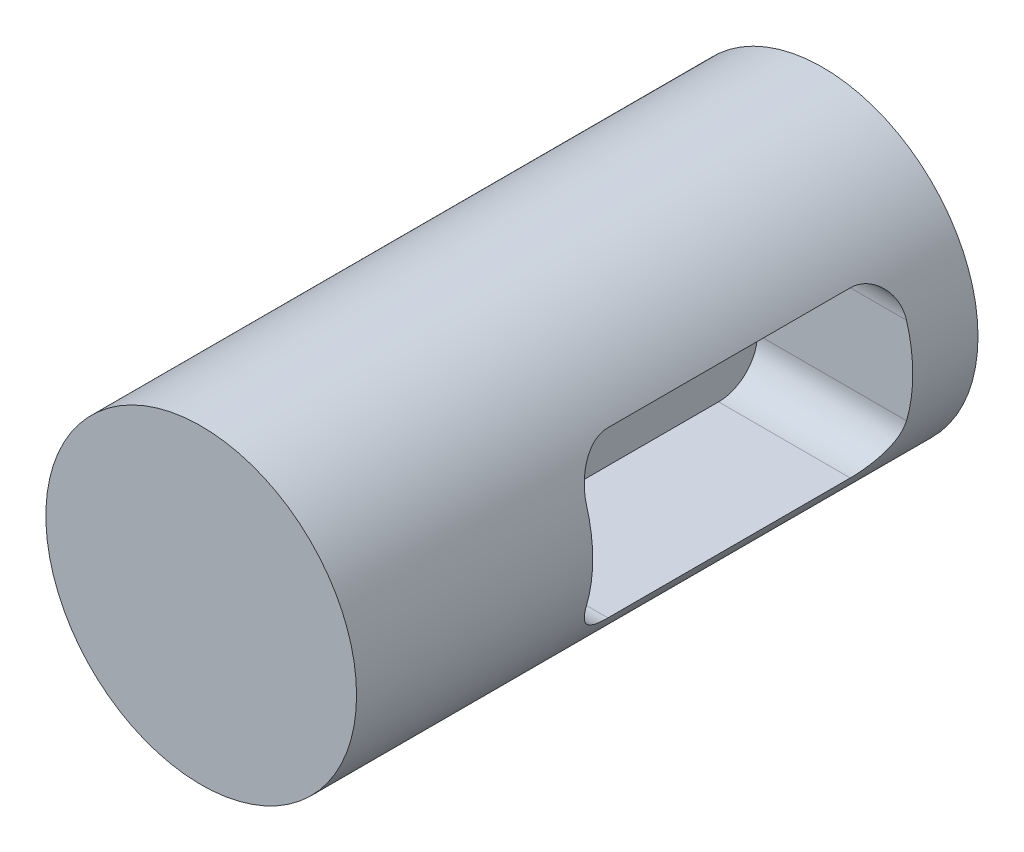
ISO-10303-21;
HEADER;
FILE_DESCRIPTION(('STEP AP214'),'2;1');
FILE_NAME('part.step','',(''),(''),'','','');
FILE_SCHEMA(('AUTOMOTIVE_DESIGN { 1 0 10303 214 1 1 1 1 }'));
ENDSEC;
DATA;
#1=APPLICATION_CONTEXT('core data for automotive mechanical design processes');
#2=APPLICATION_PROTOCOL_DEFINITION('international standard','automotive_design',2000,#1);
#3=PRODUCT_CONTEXT('',#1,'mechanical');
#4=PRODUCT('Part','Part','',(#3));
#5=PRODUCT_RELATED_PRODUCT_CATEGORY('part','',(#4));
#6=PRODUCT_DEFINITION_FORMATION('','',#4);
#7=PRODUCT_DEFINITION_CONTEXT('part definition',#1,'design');
#8=PRODUCT_DEFINITION('design','',#6,#7);
#9=PRODUCT_DEFINITION_SHAPE('','',#8);
#10=(LENGTH_UNIT() NAMED_UNIT(*) SI_UNIT(.MILLI.,.METRE.));
#11=(NAMED_UNIT(*) PLANE_ANGLE_UNIT() SI_UNIT($,.RADIAN.));
#12=(NAMED_UNIT(*) SI_UNIT($,.STERADIAN.) SOLID_ANGLE_UNIT());
#13=UNCERTAINTY_MEASURE_WITH_UNIT(LENGTH_MEASURE(1.E-05),#10,'distance_accuracy_value','');
#14=(GEOMETRIC_REPRESENTATION_CONTEXT(3) GLOBAL_UNCERTAINTY_ASSIGNED_CONTEXT((#13)) GLOBAL_UNIT_ASSIGNED_CONTEXT((#10,
#11,#12)) REPRESENTATION_CONTEXT('',''));
#15=CARTESIAN_POINT('',(0.,0.,0.));
#16=DIRECTION('',(0.,0.,1.));
#17=DIRECTION('',(1.,0.,0.));
#18=AXIS2_PLACEMENT_3D('',#15,#16,#17);
#19=CARTESIAN_POINT('',(0.,0.,25.4));
#20=DIRECTION('',(0.,0.,-1.));
#21=DIRECTION('',(-1.,0.,0.));
#22=AXIS2_PLACEMENT_3D('',#19,#20,#21);
#23=CYLINDRICAL_SURFACE('',#22,6.35);
#24=DIRECTION('',(0.,0.,-1.));
#25=VECTOR('',#24,1.);
#26=CARTESIAN_POINT('',(5.38478502356408,-3.3655,25.4));
#27=LINE('',#26,#25);
#28=CARTESIAN_POINT('',(5.38478502356408,-3.3655,4.25449999999999));
#29=VERTEX_POINT('',#28);
#30=CARTESIAN_POINT('',(5.38478502356408,-3.3655,14.1605));
#31=VERTEX_POINT('',#30);
#32=EDGE_CURVE('E108',#29,#31,#27,.F.);
#33=ORIENTED_EDGE('',*,*,#32,.T.);
#34=CARTESIAN_POINT('',(5.38478502356408,-3.3655,14.1605));
#35=CARTESIAN_POINT('',(5.38477998550626,-3.36550311420515,14.20101203173));
#36=CARTESIAN_POINT('',(5.38575522648882,-3.36394812123358,14.2415015406982));
#37=CARTESIAN_POINT('',(5.38961219981472,-3.35776719840829,14.3221329914184));
#38=CARTESIAN_POINT('',(5.39249292135221,-3.35314289673525,14.3622751060221));
#39=CARTESIAN_POINT('',(5.40386439535,-3.33481114785113,14.4812737444031));
#40=CARTESIAN_POINT('',(5.41508593867461,-3.31664348735243,14.5592361667822));
#41=CARTESIAN_POINT('',(5.44376315368653,-3.2693565459825,14.7103020550338));
#42=CARTESIAN_POINT('',(5.46120807948618,-3.24025613806757,14.7834136403405));
#43=CARTESIAN_POINT('',(5.50098527677485,-3.17225638135873,14.9235738198209));
#44=CARTESIAN_POINT('',(5.52332410052259,-3.13334388487345,14.9906141136424));
#45=CARTESIAN_POINT('',(5.57330813320664,-3.04361057836643,15.1223841627002));
#46=CARTESIAN_POINT('',(5.6012291879031,-2.99210448743698,15.186540543386));
#47=CARTESIAN_POINT('',(5.65943721389089,-2.88049223107019,15.3056353247192));
#48=CARTESIAN_POINT('',(5.68972532260729,-2.8203819194222,15.36056925335));
#49=CARTESIAN_POINT('',(5.75526538440766,-2.68436798987406,15.4670443206058));
#50=CARTESIAN_POINT('',(5.79064595234728,-2.60742699769628,15.5171871130744));
#51=CARTESIAN_POINT('',(5.86071404444277,-2.4458699687299,15.6035855213563));
#52=CARTESIAN_POINT('',(5.89540183705766,-2.36125697822874,15.6398466195068));
#53=CARTESIAN_POINT('',(5.95926042903676,-2.19473555526361,15.6945771171678));
#54=CARTESIAN_POINT('',(5.98863940672925,-2.11336753370209,15.7144363082967));
#55=CARTESIAN_POINT('',(6.0305998217557,-1.98904317353163,15.7344715475499));
#56=CARTESIAN_POINT('',(6.04424609886898,-1.94718606286673,15.7395245062857));
#57=CARTESIAN_POINT('',(6.07074320620199,-1.86293652596954,15.7462893444277));
#58=CARTESIAN_POINT('',(6.08359373197673,-1.82054390223364,15.7479999526446));
#59=CARTESIAN_POINT('',(6.096,-1.778,15.748));
#60=B_SPLINE_CURVE_WITH_KNOTS('',3,(#34,#35,#36,#37,#38,#39,#40,#41,#42,#43,#44,#45,#46,#47,#48,
#49,#50,#51,#52,#53,#54,#55,#56,#57,#58,#59),.UNSPECIFIED.,.F.,.F.,(4,2,2,2,2,2,2,2,2,2,2,2,4),
(0.,0.12145137546125,0.242838375870251,0.484034404424227,0.724815960746434,0.965921882473373,
1.22555440272633,1.48531245880474,1.77926163651441,2.07309460397963,2.33828411730118,
2.47110726953453,2.60398092829714),.UNSPECIFIED.);
#61=CARTESIAN_POINT('',(6.096,-1.778,15.748));
#62=VERTEX_POINT('',#61);
#63=EDGE_CURVE('E103',#31,#62,#60,.T.);
#64=ORIENTED_EDGE('',*,*,#63,.T.);
#65=CARTESIAN_POINT('',(0.,0.,15.748));
#66=DIRECTION('',(0.,0.,1.));
#67=DIRECTION('',(1.,0.,0.));
#68=AXIS2_PLACEMENT_3D('',#65,#66,#67);
#69=CIRCLE('',#68,6.35);
#70=CARTESIAN_POINT('',(6.096,1.778,15.748));
#71=VERTEX_POINT('',#70);
#72=EDGE_CURVE('E106',#62,#71,#69,.T.);
#73=ORIENTED_EDGE('',*,*,#72,.T.);
#74=CARTESIAN_POINT('',(6.096,1.778,15.748));
#75=CARTESIAN_POINT('',(6.08220857294816,1.82529666651743,15.747999560892));
#76=CARTESIAN_POINT('',(6.06786833797167,1.87240148720645,15.7458856209723));
#77=CARTESIAN_POINT('',(6.03821801684065,1.96591496350725,15.7375378834173));
#78=CARTESIAN_POINT('',(6.02290834754174,2.01232390786945,15.7313058458274));
#79=CARTESIAN_POINT('',(5.97580369970062,2.14979133030365,15.7066456078919));
#80=CARTESIAN_POINT('',(5.94273903782364,2.23941115383783,15.6822517666915));
#81=CARTESIAN_POINT('',(5.87470910290941,2.41224654937741,15.6187078254658));
#82=CARTESIAN_POINT('',(5.83974629858731,2.49547011524194,15.5795765172478));
#83=CARTESIAN_POINT('',(5.76945694208624,2.65393762954683,15.487634831525));
#84=CARTESIAN_POINT('',(5.73413008161663,2.72917407830562,15.434811755195));
#85=CARTESIAN_POINT('',(5.66364835809544,2.87266996410929,15.3141834079219));
#86=CARTESIAN_POINT('',(5.62855684034355,2.94053019195874,15.2458635727381));
#87=CARTESIAN_POINT('',(5.56253667857178,3.06358721613167,15.0968550416709));
#88=CARTESIAN_POINT('',(5.53160775685789,3.1187848573715,15.0161671716494));
#89=CARTESIAN_POINT('',(5.47812403660483,3.21176102360573,14.8483833153988));
#90=CARTESIAN_POINT('',(5.45522565647593,3.25027746463575,14.7618155078795));
#91=CARTESIAN_POINT('',(5.42750166735631,3.29621601765496,14.6268078280298));
#92=CARTESIAN_POINT('',(5.41936778603499,3.30955077092803,14.5809811803964));
#93=CARTESIAN_POINT('',(5.40553829228129,3.33209122457196,14.4879750237745));
#94=CARTESIAN_POINT('',(5.39984099950403,3.34129977070942,14.4407964711357));
#95=CARTESIAN_POINT('',(5.39193125314568,3.35404588613129,14.3547772182831));
#96=CARTESIAN_POINT('',(5.38925803013075,3.35833562623373,14.3160878545575));
#97=CARTESIAN_POINT('',(5.38568196644751,3.36406484368941,14.2384352931643));
#98=CARTESIAN_POINT('',(5.38477834104934,3.36550558443707,14.1994722245678));
#99=CARTESIAN_POINT('',(5.38478502356408,3.3655,14.1605));
#100=B_SPLINE_CURVE_WITH_KNOTS('',3,(#74,#75,#76,#77,#78,#79,#80,#81,#82,#83,#84,#85,#86,#87,
#88,#89,#90,#91,#92,#93,#94,#95,#96,#97,#98,#99),.UNSPECIFIED.,.F.,.F.,(4,2,2,2,2,2,2,2,2,2,2,2,
4),(0.,0.147694205216291,0.295325327783691,0.58959809839714,0.883496904016399,1.17766927605321,
1.48360289266421,1.78951608978612,2.08000601234498,2.2250399138325,2.36997363365343,
2.48688841719431,2.6037513430056),.UNSPECIFIED.);
#101=CARTESIAN_POINT('',(5.38478502356408,3.3655,14.1605));
#102=VERTEX_POINT('',#101);
#103=EDGE_CURVE('E113',#71,#102,#100,.T.);
#104=ORIENTED_EDGE('',*,*,#103,.T.);
#105=DIRECTION('',(0.,0.,-1.));
#106=VECTOR('',#105,1.);
#107=CARTESIAN_POINT('',(5.38478502356408,3.3655,25.4));
#108=LINE('',#107,#106);
#109=CARTESIAN_POINT('',(5.38478502356408,3.3655,4.25449999999999));
#110=VERTEX_POINT('',#109);
#111=EDGE_CURVE('E128',#102,#110,#108,.T.);
#112=ORIENTED_EDGE('',*,*,#111,.T.);
#113=CARTESIAN_POINT('',(5.38478502356408,3.3655,4.2545));
#114=CARTESIAN_POINT('',(5.38477998550626,3.36550311420515,4.21398796827003));
#115=CARTESIAN_POINT('',(5.38575522648882,3.36394812123358,4.17349845930179));
#116=CARTESIAN_POINT('',(5.38961219981471,3.35776719840829,4.0928670085816));
#117=CARTESIAN_POINT('',(5.39249292135221,3.35314289673525,4.05272489397793));
#118=CARTESIAN_POINT('',(5.40386439535,3.33481114785113,3.93372625559689));
#119=CARTESIAN_POINT('',(5.41508593867461,3.31664348735243,3.85576383321777));
#120=CARTESIAN_POINT('',(5.44376315368653,3.2693565459825,3.70469794496622));
#121=CARTESIAN_POINT('',(5.46120807948618,3.24025613806757,3.63158635965947));
#122=CARTESIAN_POINT('',(5.50098527677485,3.17225638135873,3.49142618017906));
#123=CARTESIAN_POINT('',(5.52332410052259,3.13334388487345,3.42438588635758));
#124=CARTESIAN_POINT('',(5.57330813320664,3.04361057836643,3.29261583729981));
#125=CARTESIAN_POINT('',(5.60122918790309,2.99210448743698,3.22845945661401));
#126=CARTESIAN_POINT('',(5.65943721389089,2.88049223107019,3.10936467528083));
#127=CARTESIAN_POINT('',(5.68972532260729,2.82038191942221,3.05443074664996));
#128=CARTESIAN_POINT('',(5.75526538440766,2.68436798987406,2.94795567939415));
#129=CARTESIAN_POINT('',(5.79064595234728,2.60742699769629,2.89781288692558));
#130=CARTESIAN_POINT('',(5.86071404444277,2.4458699687299,2.81141447864365));
#131=CARTESIAN_POINT('',(5.89540183705766,2.36125697822874,2.77515338049315));
#132=CARTESIAN_POINT('',(5.95926042903676,2.19473555526361,2.72042288283223));
#133=CARTESIAN_POINT('',(5.98863940672925,2.11336753370209,2.7005636917033));
#134=CARTESIAN_POINT('',(6.0305998217557,1.98904317353163,2.68052845245012));
#135=CARTESIAN_POINT('',(6.04424609886898,1.94718606286674,2.67547549371431));
#136=CARTESIAN_POINT('',(6.07074320620199,1.86293652596954,2.66871065557233));
#137=CARTESIAN_POINT('',(6.08359373197673,1.82054390223364,2.66700004735543));
#138=CARTESIAN_POINT('',(6.096,1.778,2.667));
#139=B_SPLINE_CURVE_WITH_KNOTS('',3,(#113,#114,#115,#116,#117,#118,#119,#120,#121,#122,#123,
#124,#125,#126,#127,#128,#129,#130,#131,#132,#133,#134,#135,#136,#137,#138),.UNSPECIFIED.,.F.,
.F.,(4,2,2,2,2,2,2,2,2,2,2,2,4),(0.,0.121451375461248,0.24283837587025,0.484034404424226,
0.724815960746434,0.965921882473373,1.22555440272632,1.48531245880474,1.77926163651441,
2.07309460397963,2.33828411730118,2.47110726953453,2.60398092829714),.UNSPECIFIED.);
#140=CARTESIAN_POINT('',(6.096,1.778,2.667));
#141=VERTEX_POINT('',#140);
#142=EDGE_CURVE('E48',#110,#141,#139,.T.);
#143=ORIENTED_EDGE('',*,*,#142,.T.);
#144=CARTESIAN_POINT('',(0.,0.,2.667));
#145=DIRECTION('',(0.,0.,-1.));
#146=DIRECTION('',(-1.,0.,0.));
#147=AXIS2_PLACEMENT_3D('',#144,#145,#146);
#148=CIRCLE('',#147,6.35);
#149=CARTESIAN_POINT('',(6.096,-1.778,2.667));
#150=VERTEX_POINT('',#149);
#151=EDGE_CURVE('E132',#141,#150,#148,.T.);
#152=ORIENTED_EDGE('',*,*,#151,.T.);
#153=CARTESIAN_POINT('',(6.096,-1.778,2.667));
#154=CARTESIAN_POINT('',(6.08220857294816,-1.82529666651743,2.66700043910802));
#155=CARTESIAN_POINT('',(6.06786833797167,-1.87240148720645,2.66911437902771));
#156=CARTESIAN_POINT('',(6.03821801684065,-1.96591496350725,2.67746211658265));
#157=CARTESIAN_POINT('',(6.02290834754174,-2.01232390786945,2.68369415417257));
#158=CARTESIAN_POINT('',(5.97580369970062,-2.14979133030365,2.70835439210806));
#159=CARTESIAN_POINT('',(5.94273903782364,-2.23941115383783,2.73274823330853));
#160=CARTESIAN_POINT('',(5.87470910290941,-2.41224654937741,2.79629217453415));
#161=CARTESIAN_POINT('',(5.83974629858731,-2.49547011524194,2.83542348275219));
#162=CARTESIAN_POINT('',(5.76945694208624,-2.65393762954683,2.927365168475));
#163=CARTESIAN_POINT('',(5.73413008161663,-2.72917407830562,2.98018824480498));
#164=CARTESIAN_POINT('',(5.66364835809544,-2.87266996410929,3.10081659207808));
#165=CARTESIAN_POINT('',(5.62855684034355,-2.94053019195874,3.16913642726188));
#166=CARTESIAN_POINT('',(5.56253667857178,-3.06358721613167,3.31814495832909));
#167=CARTESIAN_POINT('',(5.53160775685789,-3.1187848573715,3.39883282835058));
#168=CARTESIAN_POINT('',(5.47812403660483,-3.21176102360573,3.56661668460124));
#169=CARTESIAN_POINT('',(5.45522565647593,-3.25027746463575,3.65318449212054));
#170=CARTESIAN_POINT('',(5.42750166735631,-3.29621601765496,3.78819217197017));
#171=CARTESIAN_POINT('',(5.41936778603499,-3.30955077092803,3.83401881960359));
#172=CARTESIAN_POINT('',(5.40553829228129,-3.33209122457196,3.92702497622546));
#173=CARTESIAN_POINT('',(5.39984099950403,-3.34129977070942,3.97420352886431));
#174=CARTESIAN_POINT('',(5.39193125314568,-3.35404588613129,4.06022278171692));
#175=CARTESIAN_POINT('',(5.38925803013075,-3.35833562623372,4.09891214544249));
#176=CARTESIAN_POINT('',(5.38568196644751,-3.36406484368941,4.17656470683568));
#177=CARTESIAN_POINT('',(5.38477834104934,-3.36550558443707,4.21552777543217));
#178=CARTESIAN_POINT('',(5.38478502356408,-3.3655,4.25449999999999));
#179=B_SPLINE_CURVE_WITH_KNOTS('',3,(#153,#154,#155,#156,#157,#158,#159,#160,#161,#162,#163,
#164,#165,#166,#167,#168,#169,#170,#171,#172,#173,#174,#175,#176,#177,#178),.UNSPECIFIED.,.F.,
.F.,(4,2,2,2,2,2,2,2,2,2,2,2,4),(0.,0.147694205216291,0.29532532778369,0.589598098397141,
0.883496904016399,1.17766927605321,1.48360289266421,1.78951608978612,2.08000601234499,
2.2250399138325,2.36997363365344,2.48688841719431,2.6037513430056),.UNSPECIFIED.);
#180=EDGE_CURVE('E11',#150,#29,#179,.T.);
#181=ORIENTED_EDGE('',*,*,#180,.T.);
#182=EDGE_LOOP('',(#33,#64,#73,#104,#112,#143,#152,#181));
#183=FACE_BOUND('',#182,.T.);
#184=CARTESIAN_POINT('',(0.,0.,25.4));
#185=DIRECTION('',(0.,0.,1.));
#186=DIRECTION('',(1.,0.,0.));
#187=AXIS2_PLACEMENT_3D('',#184,#185,#186);
#188=CIRCLE('',#187,6.35);
#189=CARTESIAN_POINT('',(6.35,0.,25.4));
#190=VERTEX_POINT('',#189);
#191=EDGE_CURVE('E123',#190,#190,#188,.T.);
#192=ORIENTED_EDGE('',*,*,#191,.F.);
#193=EDGE_LOOP('',(#192));
#194=FACE_BOUND('',#193,.T.);
#195=CARTESIAN_POINT('',(0.,0.,0.));
#196=DIRECTION('',(0.,0.,1.));
#197=DIRECTION('',(1.,0.,0.));
#198=AXIS2_PLACEMENT_3D('',#195,#196,#197);
#199=CIRCLE('',#198,6.35);
#200=CARTESIAN_POINT('',(6.35,0.,0.));
#201=VERTEX_POINT('',#200);
#202=EDGE_CURVE('E235',#201,#201,#199,.T.);
#203=ORIENTED_EDGE('',*,*,#202,.T.);
#204=EDGE_LOOP('',(#203));
#205=FACE_BOUND('',#204,.T.);
#206=ADVANCED_FACE('F35',(#183,#194,#205),#23,.T.);
#207=CARTESIAN_POINT('',(0.,0.,25.4));
#208=DIRECTION('',(0.,0.,1.));
#209=DIRECTION('',(1.,0.,0.));
#210=AXIS2_PLACEMENT_3D('',#207,#208,#209);
#211=PLANE('',#210);
#212=ORIENTED_EDGE('',*,*,#191,.T.);
#213=EDGE_LOOP('',(#212));
#214=FACE_BOUND('',#213,.T.);
#215=ADVANCED_FACE('F184',(#214),#211,.T.);
#216=CARTESIAN_POINT('',(0.,0.,0.));
#217=DIRECTION('',(0.,0.,1.));
#218=DIRECTION('',(1.,0.,0.));
#219=AXIS2_PLACEMENT_3D('',#216,#217,#218);
#220=PLANE('',#219);
#221=ORIENTED_EDGE('',*,*,#202,.F.);
#222=EDGE_LOOP('',(#221));
#223=FACE_BOUND('',#222,.T.);
#224=ADVANCED_FACE('F188',(#223),#220,.F.);
#225=CARTESIAN_POINT('',(0.,-3.3655,2.667));
#226=DIRECTION('',(0.,0.,-1.));
#227=DIRECTION('',(-1.,0.,0.));
#228=AXIS2_PLACEMENT_3D('',#225,#226,#227);
#229=PLANE('',#228);
#230=ORIENTED_EDGE('',*,*,#151,.F.);
#231=DIRECTION('',(1.,0.,0.));
#232=VECTOR('',#231,1.);
#233=CARTESIAN_POINT('',(0.,1.778,2.667));
#234=LINE('',#233,#232);
#235=CARTESIAN_POINT('',(0.,1.778,2.667));
#236=VERTEX_POINT('',#235);
#237=EDGE_CURVE('E153',#141,#236,#234,.F.);
#238=ORIENTED_EDGE('',*,*,#237,.T.);
#239=DIRECTION('',(0.,1.,0.));
#240=VECTOR('',#239,1.);
#241=CARTESIAN_POINT('',(0.,-3.3655,2.667));
#242=LINE('',#241,#240);
#243=CARTESIAN_POINT('',(0.,-1.778,2.667));
#244=VERTEX_POINT('',#243);
#245=EDGE_CURVE('E222',#244,#236,#242,.T.);
#246=ORIENTED_EDGE('',*,*,#245,.F.);
#247=DIRECTION('',(1.,0.,0.));
#248=VECTOR('',#247,1.);
#249=CARTESIAN_POINT('',(5.38478502356408,-1.778,2.667));
#250=LINE('',#249,#248);
#251=EDGE_CURVE('E151',#244,#150,#250,.T.);
#252=ORIENTED_EDGE('',*,*,#251,.T.);
#253=EDGE_LOOP('',(#230,#238,#246,#252));
#254=FACE_BOUND('',#253,.T.);
#255=ADVANCED_FACE('F194',(#254),#229,.F.);
#256=CARTESIAN_POINT('',(0.,-3.3655,15.748));
#257=DIRECTION('',(0.,-1.,0.));
#258=DIRECTION('',(0.,0.,-1.));
#259=AXIS2_PLACEMENT_3D('',#256,#257,#258);
#260=PLANE('',#259);
#261=DIRECTION('',(0.,0.,-1.));
#262=VECTOR('',#261,1.);
#263=CARTESIAN_POINT('',(0.,-3.3655,15.748));
#264=LINE('',#263,#262);
#265=CARTESIAN_POINT('',(0.,-3.3655,14.1605));
#266=VERTEX_POINT('',#265);
#267=CARTESIAN_POINT('',(0.,-3.3655,4.2545));
#268=VERTEX_POINT('',#267);
#269=EDGE_CURVE('E233',#266,#268,#264,.T.);
#270=ORIENTED_EDGE('',*,*,#269,.F.);
#271=DIRECTION('',(1.,0.,0.));
#272=VECTOR('',#271,1.);
#273=CARTESIAN_POINT('',(5.38478502356408,-3.3655,14.1605));
#274=LINE('',#273,#272);
#275=EDGE_CURVE('E149',#266,#31,#274,.T.);
#276=ORIENTED_EDGE('',*,*,#275,.T.);
#277=ORIENTED_EDGE('',*,*,#32,.F.);
#278=DIRECTION('',(1.,0.,0.));
#279=VECTOR('',#278,1.);
#280=CARTESIAN_POINT('',(0.,-3.3655,4.2545));
#281=LINE('',#280,#279);
#282=EDGE_CURVE('E147',#29,#268,#281,.F.);
#283=ORIENTED_EDGE('',*,*,#282,.T.);
#284=EDGE_LOOP('',(#270,#276,#277,#283));
#285=FACE_BOUND('',#284,.T.);
#286=ADVANCED_FACE('F200',(#285),#260,.F.);
#287=CARTESIAN_POINT('',(0.,-3.3655,15.748));
#288=DIRECTION('',(0.,0.,1.));
#289=DIRECTION('',(1.,0.,0.));
#290=AXIS2_PLACEMENT_3D('',#287,#288,#289);
#291=PLANE('',#290);
#292=DIRECTION('',(0.,-1.,0.));
#293=VECTOR('',#292,1.);
#294=CARTESIAN_POINT('',(0.,-3.3655,15.748));
#295=LINE('',#294,#293);
#296=CARTESIAN_POINT('',(0.,1.778,15.748));
#297=VERTEX_POINT('',#296);
#298=CARTESIAN_POINT('',(0.,-1.778,15.748));
#299=VERTEX_POINT('',#298);
#300=EDGE_CURVE('E221',#297,#299,#295,.T.);
#301=ORIENTED_EDGE('',*,*,#300,.F.);
#302=DIRECTION('',(1.,0.,0.));
#303=VECTOR('',#302,1.);
#304=CARTESIAN_POINT('',(5.38478502356408,1.778,15.748));
#305=LINE('',#304,#303);
#306=EDGE_CURVE('E122',#297,#71,#305,.T.);
#307=ORIENTED_EDGE('',*,*,#306,.T.);
#308=ORIENTED_EDGE('',*,*,#72,.F.);
#309=DIRECTION('',(1.,0.,0.));
#310=VECTOR('',#309,1.);
#311=CARTESIAN_POINT('',(0.,-1.778,15.748));
#312=LINE('',#311,#310);
#313=EDGE_CURVE('E119',#62,#299,#312,.F.);
#314=ORIENTED_EDGE('',*,*,#313,.T.);
#315=EDGE_LOOP('',(#301,#307,#308,#314));
#316=FACE_BOUND('',#315,.T.);
#317=ADVANCED_FACE('F118',(#316),#291,.F.);
#318=CARTESIAN_POINT('',(0.,3.3655,15.748));
#319=DIRECTION('',(0.,1.,0.));
#320=DIRECTION('',(0.,0.,1.));
#321=AXIS2_PLACEMENT_3D('',#318,#319,#320);
#322=PLANE('',#321);
#323=ORIENTED_EDGE('',*,*,#111,.F.);
#324=DIRECTION('',(1.,0.,0.));
#325=VECTOR('',#324,1.);
#326=CARTESIAN_POINT('',(0.,3.3655,14.1605));
#327=LINE('',#326,#325);
#328=CARTESIAN_POINT('',(0.,3.3655,14.1605));
#329=VERTEX_POINT('',#328);
#330=EDGE_CURVE('E138',#102,#329,#327,.F.);
#331=ORIENTED_EDGE('',*,*,#330,.T.);
#332=DIRECTION('',(0.,0.,1.));
#333=VECTOR('',#332,1.);
#334=CARTESIAN_POINT('',(0.,3.3655,15.748));
#335=LINE('',#334,#333);
#336=CARTESIAN_POINT('',(0.,3.3655,4.2545));
#337=VERTEX_POINT('',#336);
#338=EDGE_CURVE('E217',#337,#329,#335,.T.);
#339=ORIENTED_EDGE('',*,*,#338,.F.);
#340=DIRECTION('',(1.,0.,0.));
#341=VECTOR('',#340,1.);
#342=CARTESIAN_POINT('',(5.38478502356408,3.3655,4.2545));
#343=LINE('',#342,#341);
#344=EDGE_CURVE('E130',#337,#110,#343,.T.);
#345=ORIENTED_EDGE('',*,*,#344,.T.);
#346=EDGE_LOOP('',(#323,#331,#339,#345));
#347=FACE_BOUND('',#346,.T.);
#348=ADVANCED_FACE('F202',(#347),#322,.F.);
#349=CARTESIAN_POINT('',(0.,0.,0.));
#350=DIRECTION('',(-1.,0.,0.));
#351=DIRECTION('',(0.,0.,1.));
#352=AXIS2_PLACEMENT_3D('',#349,#350,#351);
#353=PLANE('',#352);
#354=ORIENTED_EDGE('',*,*,#338,.T.);
#355=CARTESIAN_POINT('',(0.,1.778,14.1605));
#356=DIRECTION('',(-1.,0.,0.));
#357=DIRECTION('',(0.,0.,1.));
#358=AXIS2_PLACEMENT_3D('',#355,#356,#357);
#359=CIRCLE('',#358,1.5875);
#360=EDGE_CURVE('E145',#329,#297,#359,.F.);
#361=ORIENTED_EDGE('',*,*,#360,.T.);
#362=ORIENTED_EDGE('',*,*,#300,.T.);
#363=CARTESIAN_POINT('',(0.,-1.778,14.1605));
#364=DIRECTION('',(-1.,0.,0.));
#365=DIRECTION('',(0.,0.,1.));
#366=AXIS2_PLACEMENT_3D('',#363,#364,#365);
#367=CIRCLE('',#366,1.5875);
#368=EDGE_CURVE('E127',#299,#266,#367,.F.);
#369=ORIENTED_EDGE('',*,*,#368,.T.);
#370=ORIENTED_EDGE('',*,*,#269,.T.);
#371=CARTESIAN_POINT('',(0.,-1.778,4.2545));
#372=DIRECTION('',(-1.,0.,0.));
#373=DIRECTION('',(0.,0.,1.));
#374=AXIS2_PLACEMENT_3D('',#371,#372,#373);
#375=CIRCLE('',#374,1.5875);
#376=EDGE_CURVE('E140',#268,#244,#375,.F.);
#377=ORIENTED_EDGE('',*,*,#376,.T.);
#378=ORIENTED_EDGE('',*,*,#245,.T.);
#379=CARTESIAN_POINT('',(0.,1.778,4.2545));
#380=DIRECTION('',(-1.,0.,0.));
#381=DIRECTION('',(0.,0.,1.));
#382=AXIS2_PLACEMENT_3D('',#379,#380,#381);
#383=CIRCLE('',#382,1.5875);
#384=EDGE_CURVE('E142',#236,#337,#383,.F.);
#385=ORIENTED_EDGE('',*,*,#384,.T.);
#386=EDGE_LOOP('',(#354,#361,#362,#369,#370,#377,#378,#385));
#387=FACE_BOUND('',#386,.T.);
#388=ADVANCED_FACE('F168',(#387),#353,.F.);
#389=CARTESIAN_POINT('',(0.,1.778,14.1605));
#390=DIRECTION('',(-1.,0.,0.));
#391=DIRECTION('',(0.,0.,1.));
#392=AXIS2_PLACEMENT_3D('',#389,#390,#391);
#393=CYLINDRICAL_SURFACE('',#392,1.5875);
#394=ORIENTED_EDGE('',*,*,#360,.F.);
#395=ORIENTED_EDGE('',*,*,#330,.F.);
#396=ORIENTED_EDGE('',*,*,#103,.F.);
#397=ORIENTED_EDGE('',*,*,#306,.F.);
#398=EDGE_LOOP('',(#394,#395,#396,#397));
#399=FACE_BOUND('',#398,.T.);
#400=ADVANCED_FACE('F165',(#399),#393,.F.);
#401=CARTESIAN_POINT('',(0.,-1.778,14.1605));
#402=DIRECTION('',(-1.,0.,0.));
#403=DIRECTION('',(0.,0.,1.));
#404=AXIS2_PLACEMENT_3D('',#401,#402,#403);
#405=CYLINDRICAL_SURFACE('',#404,1.5875);
#406=ORIENTED_EDGE('',*,*,#368,.F.);
#407=ORIENTED_EDGE('',*,*,#313,.F.);
#408=ORIENTED_EDGE('',*,*,#63,.F.);
#409=ORIENTED_EDGE('',*,*,#275,.F.);
#410=EDGE_LOOP('',(#406,#407,#408,#409));
#411=FACE_BOUND('',#410,.T.);
#412=ADVANCED_FACE('F126',(#411),#405,.F.);
#413=CARTESIAN_POINT('',(0.,1.778,4.2545));
#414=DIRECTION('',(-1.,0.,0.));
#415=DIRECTION('',(0.,0.,1.));
#416=AXIS2_PLACEMENT_3D('',#413,#414,#415);
#417=CYLINDRICAL_SURFACE('',#416,1.5875);
#418=ORIENTED_EDGE('',*,*,#384,.F.);
#419=ORIENTED_EDGE('',*,*,#237,.F.);
#420=ORIENTED_EDGE('',*,*,#142,.F.);
#421=ORIENTED_EDGE('',*,*,#344,.F.);
#422=EDGE_LOOP('',(#418,#419,#420,#421));
#423=FACE_BOUND('',#422,.T.);
#424=ADVANCED_FACE('F172',(#423),#417,.F.);
#425=CARTESIAN_POINT('',(0.,-1.778,4.2545));
#426=DIRECTION('',(-1.,0.,0.));
#427=DIRECTION('',(0.,0.,1.));
#428=AXIS2_PLACEMENT_3D('',#425,#426,#427);
#429=CYLINDRICAL_SURFACE('',#428,1.5875);
#430=ORIENTED_EDGE('',*,*,#376,.F.);
#431=ORIENTED_EDGE('',*,*,#282,.F.);
#432=ORIENTED_EDGE('',*,*,#180,.F.);
#433=ORIENTED_EDGE('',*,*,#251,.F.);
#434=EDGE_LOOP('',(#430,#431,#432,#433));
#435=FACE_BOUND('',#434,.T.);
#436=ADVANCED_FACE('F37',(#435),#429,.F.);
#437=CLOSED_SHELL('',(#206,#215,#224,#255,#286,#317,#348,#388,#400,#412,#424,#436));
#438=MANIFOLD_SOLID_BREP('B2',#437);
#439=ADVANCED_BREP_SHAPE_REPRESENTATION('',(#18,#438),#14);
#440=SHAPE_DEFINITION_REPRESENTATION(#9,#439);
ENDSEC;
END-ISO-10303-21;
